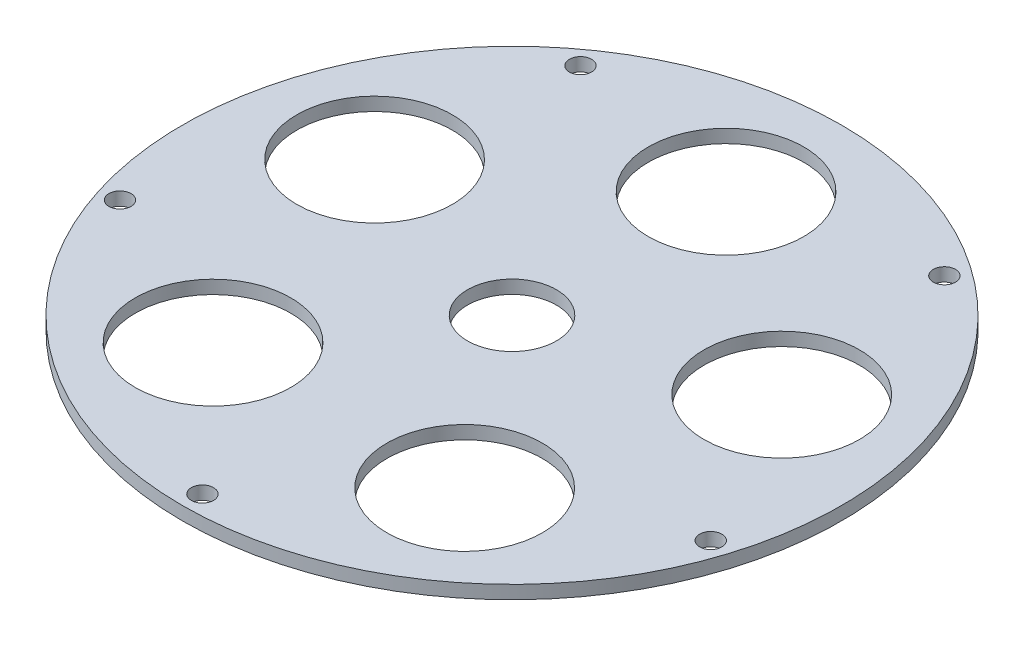
ISO-10303-21;
HEADER;
FILE_DESCRIPTION(('STEP AP214'),'2;1');
FILE_NAME('part.step','',(''),(''),'','','');
FILE_SCHEMA(('AUTOMOTIVE_DESIGN { 1 0 10303 214 1 1 1 1 }'));
ENDSEC;
DATA;
#1=APPLICATION_CONTEXT('core data for automotive mechanical design processes');
#2=APPLICATION_PROTOCOL_DEFINITION('international standard','automotive_design',2000,#1);
#3=PRODUCT_CONTEXT('',#1,'mechanical');
#4=PRODUCT('Part','Part','',(#3));
#5=PRODUCT_RELATED_PRODUCT_CATEGORY('part','',(#4));
#6=PRODUCT_DEFINITION_FORMATION('','',#4);
#7=PRODUCT_DEFINITION_CONTEXT('part definition',#1,'design');
#8=PRODUCT_DEFINITION('design','',#6,#7);
#9=PRODUCT_DEFINITION_SHAPE('','',#8);
#10=(LENGTH_UNIT() NAMED_UNIT(*) SI_UNIT(.MILLI.,.METRE.));
#11=(NAMED_UNIT(*) PLANE_ANGLE_UNIT() SI_UNIT($,.RADIAN.));
#12=(NAMED_UNIT(*) SI_UNIT($,.STERADIAN.) SOLID_ANGLE_UNIT());
#13=UNCERTAINTY_MEASURE_WITH_UNIT(LENGTH_MEASURE(1.E-05),#10,'distance_accuracy_value','');
#14=(GEOMETRIC_REPRESENTATION_CONTEXT(3) GLOBAL_UNCERTAINTY_ASSIGNED_CONTEXT((#13)) GLOBAL_UNIT_ASSIGNED_CONTEXT((#10,
#11,#12)) REPRESENTATION_CONTEXT('',''));
#15=CARTESIAN_POINT('',(0.,0.,0.));
#16=DIRECTION('',(0.,0.,1.));
#17=DIRECTION('',(1.,0.,0.));
#18=AXIS2_PLACEMENT_3D('',#15,#16,#17);
#19=CARTESIAN_POINT('',(0.,-3.,0.));
#20=DIRECTION('',(0.,1.,0.));
#21=DIRECTION('',(0.,0.,1.));
#22=AXIS2_PLACEMENT_3D('',#19,#20,#21);
#23=CYLINDRICAL_SURFACE('',#22,74.18267629);
#24=CARTESIAN_POINT('',(0.,-3.,0.));
#25=DIRECTION('',(0.,1.,0.));
#26=DIRECTION('',(0.,0.,1.));
#27=AXIS2_PLACEMENT_3D('',#24,#25,#26);
#28=CIRCLE('',#27,74.18267629);
#29=CARTESIAN_POINT('',(0.,-3.,74.18267629));
#30=VERTEX_POINT('',#29);
#31=EDGE_CURVE('E10',#30,#30,#28,.T.);
#32=ORIENTED_EDGE('',*,*,#31,.T.);
#33=EDGE_LOOP('',(#32));
#34=FACE_BOUND('',#33,.T.);
#35=CARTESIAN_POINT('',(0.,0.,0.));
#36=DIRECTION('',(0.,1.,0.));
#37=DIRECTION('',(0.,0.,1.));
#38=AXIS2_PLACEMENT_3D('',#35,#36,#37);
#39=CIRCLE('',#38,74.18267629);
#40=CARTESIAN_POINT('',(0.,0.,74.18267629));
#41=VERTEX_POINT('',#40);
#42=EDGE_CURVE('E34',#41,#41,#39,.T.);
#43=ORIENTED_EDGE('',*,*,#42,.F.);
#44=EDGE_LOOP('',(#43));
#45=FACE_BOUND('',#44,.T.);
#46=ADVANCED_FACE('F31',(#34,#45),#23,.T.);
#47=CARTESIAN_POINT('',(0.,-3.,0.));
#48=DIRECTION('',(0.,1.,0.));
#49=DIRECTION('',(0.,0.,1.));
#50=AXIS2_PLACEMENT_3D('',#47,#48,#49);
#51=PLANE('',#50);
#52=CARTESIAN_POINT('',(-66.6050331391941,-3.,21.6412871351681));
#53=DIRECTION('',(0.,1.,0.));
#54=DIRECTION('',(0.,0.,1.));
#55=AXIS2_PLACEMENT_3D('',#52,#53,#54);
#56=CIRCLE('',#55,2.50000000000001);
#57=CARTESIAN_POINT('',(-66.6050331391941,-3.,24.1412871351681));
#58=VERTEX_POINT('',#57);
#59=EDGE_CURVE('E68',#58,#58,#56,.T.);
#60=ORIENTED_EDGE('',*,*,#59,.T.);
#61=EDGE_LOOP('',(#60));
#62=FACE_BOUND('',#61,.T.);
#63=CARTESIAN_POINT('',(0.,-3.,69.68267629));
#64=DIRECTION('',(0.,1.,0.));
#65=DIRECTION('',(0.,0.,1.));
#66=AXIS2_PLACEMENT_3D('',#63,#64,#65);
#67=CIRCLE('',#66,2.5);
#68=CARTESIAN_POINT('',(0.,-3.,72.18267629));
#69=VERTEX_POINT('',#68);
#70=EDGE_CURVE('E81',#69,#69,#67,.T.);
#71=ORIENTED_EDGE('',*,*,#70,.T.);
#72=EDGE_LOOP('',(#71));
#73=FACE_BOUND('',#72,.T.);
#74=CARTESIAN_POINT('',(66.2721633584904,-3.,21.5331311871379));
#75=DIRECTION('',(0.,1.,0.));
#76=DIRECTION('',(0.,0.,1.));
#77=AXIS2_PLACEMENT_3D('',#74,#75,#76);
#78=CIRCLE('',#77,2.50000000000001);
#79=CARTESIAN_POINT('',(66.2721633584904,-3.,24.0331311871379));
#80=VERTEX_POINT('',#79);
#81=EDGE_CURVE('E84',#80,#80,#78,.T.);
#82=ORIENTED_EDGE('',*,*,#81,.T.);
#83=EDGE_LOOP('',(#82));
#84=FACE_BOUND('',#83,.T.);
#85=CARTESIAN_POINT('',(40.9584494635325,-3.,-56.3744693321382));
#86=DIRECTION('',(0.,1.,0.));
#87=DIRECTION('',(0.,0.,1.));
#88=AXIS2_PLACEMENT_3D('',#85,#86,#87);
#89=CIRCLE('',#88,2.5);
#90=CARTESIAN_POINT('',(40.9584494635325,-3.,-53.8744693321382));
#91=VERTEX_POINT('',#90);
#92=EDGE_CURVE('E87',#91,#91,#89,.T.);
#93=ORIENTED_EDGE('',*,*,#92,.T.);
#94=EDGE_LOOP('',(#93));
#95=FACE_BOUND('',#94,.T.);
#96=CARTESIAN_POINT('',(-40.9584494635321,-3.,-56.3744693321385));
#97=DIRECTION('',(0.,1.,0.));
#98=DIRECTION('',(0.,0.,1.));
#99=AXIS2_PLACEMENT_3D('',#96,#97,#98);
#100=CIRCLE('',#99,2.5);
#101=CARTESIAN_POINT('',(-40.9584494635321,-3.,-53.8744693321385));
#102=VERTEX_POINT('',#101);
#103=EDGE_CURVE('E90',#102,#102,#100,.T.);
#104=ORIENTED_EDGE('',*,*,#103,.T.);
#105=EDGE_LOOP('',(#104));
#106=FACE_BOUND('',#105,.T.);
#107=CARTESIAN_POINT('',(-45.8244482581448,-3.,-14.8892658080759));
#108=DIRECTION('',(0.,1.,0.));
#109=DIRECTION('',(0.,0.,1.));
#110=AXIS2_PLACEMENT_3D('',#107,#108,#109);
#111=CIRCLE('',#110,17.5);
#112=CARTESIAN_POINT('',(-45.8244482581448,-3.,2.61073419192412));
#113=VERTEX_POINT('',#112);
#114=EDGE_CURVE('E41',#113,#113,#111,.T.);
#115=ORIENTED_EDGE('',*,*,#114,.T.);
#116=EDGE_LOOP('',(#115));
#117=FACE_BOUND('',#116,.T.);
#118=CARTESIAN_POINT('',(28.3210665392446,-3.,38.9806039530766));
#119=DIRECTION('',(0.,1.,0.));
#120=DIRECTION('',(0.,0.,1.));
#121=AXIS2_PLACEMENT_3D('',#118,#119,#120);
#122=CIRCLE('',#121,17.5);
#123=CARTESIAN_POINT('',(28.3210665392446,-3.,56.4806039530766));
#124=VERTEX_POINT('',#123);
#125=EDGE_CURVE('E45',#124,#124,#122,.T.);
#126=ORIENTED_EDGE('',*,*,#125,.T.);
#127=EDGE_LOOP('',(#126));
#128=FACE_BOUND('',#127,.T.);
#129=CARTESIAN_POINT('',(45.8244482581444,-3.,-14.8892658080771));
#130=DIRECTION('',(0.,1.,0.));
#131=DIRECTION('',(0.,0.,1.));
#132=AXIS2_PLACEMENT_3D('',#129,#130,#131);
#133=CIRCLE('',#132,17.5);
#134=CARTESIAN_POINT('',(45.8244482581444,-3.,2.61073419192296));
#135=VERTEX_POINT('',#134);
#136=EDGE_CURVE('E48',#135,#135,#133,.T.);
#137=ORIENTED_EDGE('',*,*,#136,.T.);
#138=EDGE_LOOP('',(#137));
#139=FACE_BOUND('',#138,.T.);
#140=CARTESIAN_POINT('',(0.,-3.,-48.18267629));
#141=DIRECTION('',(0.,1.,0.));
#142=DIRECTION('',(0.,0.,1.));
#143=AXIS2_PLACEMENT_3D('',#140,#141,#142);
#144=CIRCLE('',#143,17.5);
#145=CARTESIAN_POINT('',(0.,-3.,-30.68267629));
#146=VERTEX_POINT('',#145);
#147=EDGE_CURVE('E51',#146,#146,#144,.T.);
#148=ORIENTED_EDGE('',*,*,#147,.T.);
#149=EDGE_LOOP('',(#148));
#150=FACE_BOUND('',#149,.T.);
#151=CARTESIAN_POINT('',(0.,-3.,0.));
#152=DIRECTION('',(0.,1.,0.));
#153=DIRECTION('',(0.,0.,1.));
#154=AXIS2_PLACEMENT_3D('',#151,#152,#153);
#155=CIRCLE('',#154,10.);
#156=CARTESIAN_POINT('',(0.,-3.,10.));
#157=VERTEX_POINT('',#156);
#158=EDGE_CURVE('E54',#157,#157,#155,.T.);
#159=ORIENTED_EDGE('',*,*,#158,.T.);
#160=EDGE_LOOP('',(#159));
#161=FACE_BOUND('',#160,.T.);
#162=CARTESIAN_POINT('',(-28.3210665392436,-3.,38.9806039530773));
#163=DIRECTION('',(0.,1.,0.));
#164=DIRECTION('',(0.,0.,1.));
#165=AXIS2_PLACEMENT_3D('',#162,#163,#164);
#166=CIRCLE('',#165,17.5);
#167=CARTESIAN_POINT('',(-28.3210665392436,-3.,56.4806039530773));
#168=VERTEX_POINT('',#167);
#169=EDGE_CURVE('E57',#168,#168,#166,.T.);
#170=ORIENTED_EDGE('',*,*,#169,.T.);
#171=EDGE_LOOP('',(#170));
#172=FACE_BOUND('',#171,.T.);
#173=ORIENTED_EDGE('',*,*,#31,.F.);
#174=EDGE_LOOP('',(#173));
#175=FACE_BOUND('',#174,.T.);
#176=ADVANCED_FACE('F116',(#62,#73,#84,#95,#106,#117,#128,#139,#150,#161,#172,#175),#51,.F.);
#177=CARTESIAN_POINT('',(0.,0.,0.));
#178=DIRECTION('',(0.,1.,0.));
#179=DIRECTION('',(0.,0.,1.));
#180=AXIS2_PLACEMENT_3D('',#177,#178,#179);
#181=PLANE('',#180);
#182=CARTESIAN_POINT('',(-66.6050331391941,0.,21.6412871351681));
#183=DIRECTION('',(0.,1.,0.));
#184=DIRECTION('',(0.,0.,1.));
#185=AXIS2_PLACEMENT_3D('',#182,#183,#184);
#186=CIRCLE('',#185,2.50000000000001);
#187=CARTESIAN_POINT('',(-66.6050331391941,0.,24.1412871351681));
#188=VERTEX_POINT('',#187);
#189=EDGE_CURVE('E93',#188,#188,#186,.T.);
#190=ORIENTED_EDGE('',*,*,#189,.F.);
#191=EDGE_LOOP('',(#190));
#192=FACE_BOUND('',#191,.T.);
#193=CARTESIAN_POINT('',(0.,0.,69.68267629));
#194=DIRECTION('',(0.,1.,0.));
#195=DIRECTION('',(0.,0.,1.));
#196=AXIS2_PLACEMENT_3D('',#193,#194,#195);
#197=CIRCLE('',#196,2.5);
#198=CARTESIAN_POINT('',(0.,0.,72.18267629));
#199=VERTEX_POINT('',#198);
#200=EDGE_CURVE('E103',#199,#199,#197,.T.);
#201=ORIENTED_EDGE('',*,*,#200,.F.);
#202=EDGE_LOOP('',(#201));
#203=FACE_BOUND('',#202,.T.);
#204=CARTESIAN_POINT('',(66.2721633584904,0.,21.5331311871379));
#205=DIRECTION('',(0.,1.,0.));
#206=DIRECTION('',(0.,0.,1.));
#207=AXIS2_PLACEMENT_3D('',#204,#205,#206);
#208=CIRCLE('',#207,2.50000000000001);
#209=CARTESIAN_POINT('',(66.2721633584904,0.,24.0331311871379));
#210=VERTEX_POINT('',#209);
#211=EDGE_CURVE('E100',#210,#210,#208,.T.);
#212=ORIENTED_EDGE('',*,*,#211,.F.);
#213=EDGE_LOOP('',(#212));
#214=FACE_BOUND('',#213,.T.);
#215=CARTESIAN_POINT('',(40.9584494635325,0.,-56.3744693321382));
#216=DIRECTION('',(0.,1.,0.));
#217=DIRECTION('',(0.,0.,1.));
#218=AXIS2_PLACEMENT_3D('',#215,#216,#217);
#219=CIRCLE('',#218,2.5);
#220=CARTESIAN_POINT('',(40.9584494635325,0.,-53.8744693321382));
#221=VERTEX_POINT('',#220);
#222=EDGE_CURVE('E97',#221,#221,#219,.T.);
#223=ORIENTED_EDGE('',*,*,#222,.F.);
#224=EDGE_LOOP('',(#223));
#225=FACE_BOUND('',#224,.T.);
#226=CARTESIAN_POINT('',(-40.9584494635321,0.,-56.3744693321385));
#227=DIRECTION('',(0.,1.,0.));
#228=DIRECTION('',(0.,0.,1.));
#229=AXIS2_PLACEMENT_3D('',#226,#227,#228);
#230=CIRCLE('',#229,2.5);
#231=CARTESIAN_POINT('',(-40.9584494635321,0.,-53.8744693321385));
#232=VERTEX_POINT('',#231);
#233=EDGE_CURVE('E94',#232,#232,#230,.T.);
#234=ORIENTED_EDGE('',*,*,#233,.F.);
#235=EDGE_LOOP('',(#234));
#236=FACE_BOUND('',#235,.T.);
#237=CARTESIAN_POINT('',(-45.8244482581448,0.,-14.8892658080759));
#238=DIRECTION('',(0.,1.,0.));
#239=DIRECTION('',(0.,0.,1.));
#240=AXIS2_PLACEMENT_3D('',#237,#238,#239);
#241=CIRCLE('',#240,17.5);
#242=CARTESIAN_POINT('',(-45.8244482581448,0.,2.61073419192412));
#243=VERTEX_POINT('',#242);
#244=EDGE_CURVE('E64',#243,#243,#241,.T.);
#245=ORIENTED_EDGE('',*,*,#244,.F.);
#246=EDGE_LOOP('',(#245));
#247=FACE_BOUND('',#246,.T.);
#248=CARTESIAN_POINT('',(28.3210665392446,0.,38.9806039530766));
#249=DIRECTION('',(0.,1.,0.));
#250=DIRECTION('',(0.,0.,1.));
#251=AXIS2_PLACEMENT_3D('',#248,#249,#250);
#252=CIRCLE('',#251,17.5);
#253=CARTESIAN_POINT('',(28.3210665392446,0.,56.4806039530766));
#254=VERTEX_POINT('',#253);
#255=EDGE_CURVE('E63',#254,#254,#252,.T.);
#256=ORIENTED_EDGE('',*,*,#255,.F.);
#257=EDGE_LOOP('',(#256));
#258=FACE_BOUND('',#257,.T.);
#259=CARTESIAN_POINT('',(45.8244482581444,0.,-14.8892658080771));
#260=DIRECTION('',(0.,1.,0.));
#261=DIRECTION('',(0.,0.,1.));
#262=AXIS2_PLACEMENT_3D('',#259,#260,#261);
#263=CIRCLE('',#262,17.5);
#264=CARTESIAN_POINT('',(45.8244482581444,0.,2.61073419192296));
#265=VERTEX_POINT('',#264);
#266=EDGE_CURVE('E69',#265,#265,#263,.T.);
#267=ORIENTED_EDGE('',*,*,#266,.F.);
#268=EDGE_LOOP('',(#267));
#269=FACE_BOUND('',#268,.T.);
#270=CARTESIAN_POINT('',(0.,0.,-48.18267629));
#271=DIRECTION('',(0.,1.,0.));
#272=DIRECTION('',(0.,0.,1.));
#273=AXIS2_PLACEMENT_3D('',#270,#271,#272);
#274=CIRCLE('',#273,17.5);
#275=CARTESIAN_POINT('',(0.,0.,-30.68267629));
#276=VERTEX_POINT('',#275);
#277=EDGE_CURVE('E72',#276,#276,#274,.T.);
#278=ORIENTED_EDGE('',*,*,#277,.F.);
#279=EDGE_LOOP('',(#278));
#280=FACE_BOUND('',#279,.T.);
#281=CARTESIAN_POINT('',(0.,0.,0.));
#282=DIRECTION('',(0.,1.,0.));
#283=DIRECTION('',(0.,0.,1.));
#284=AXIS2_PLACEMENT_3D('',#281,#282,#283);
#285=CIRCLE('',#284,10.);
#286=CARTESIAN_POINT('',(0.,0.,10.));
#287=VERTEX_POINT('',#286);
#288=EDGE_CURVE('E67',#287,#287,#285,.T.);
#289=ORIENTED_EDGE('',*,*,#288,.F.);
#290=EDGE_LOOP('',(#289));
#291=FACE_BOUND('',#290,.T.);
#292=CARTESIAN_POINT('',(-28.3210665392436,0.,38.9806039530773));
#293=DIRECTION('',(0.,1.,0.));
#294=DIRECTION('',(0.,0.,1.));
#295=AXIS2_PLACEMENT_3D('',#292,#293,#294);
#296=CIRCLE('',#295,17.5);
#297=CARTESIAN_POINT('',(-28.3210665392436,0.,56.4806039530773));
#298=VERTEX_POINT('',#297);
#299=EDGE_CURVE('E60',#298,#298,#296,.T.);
#300=ORIENTED_EDGE('',*,*,#299,.F.);
#301=EDGE_LOOP('',(#300));
#302=FACE_BOUND('',#301,.T.);
#303=ORIENTED_EDGE('',*,*,#42,.T.);
#304=EDGE_LOOP('',(#303));
#305=FACE_BOUND('',#304,.T.);
#306=ADVANCED_FACE('F112',(#192,#203,#214,#225,#236,#247,#258,#269,#280,#291,#302,#305),#181,.T.);
#307=CARTESIAN_POINT('',(-28.3210665392436,-4.,38.9806039530773));
#308=DIRECTION('',(0.,1.,0.));
#309=DIRECTION('',(0.,0.,1.));
#310=AXIS2_PLACEMENT_3D('',#307,#308,#309);
#311=CYLINDRICAL_SURFACE('',#310,17.5);
#312=ORIENTED_EDGE('',*,*,#299,.T.);
#313=EDGE_LOOP('',(#312));
#314=FACE_BOUND('',#313,.T.);
#315=ORIENTED_EDGE('',*,*,#169,.F.);
#316=EDGE_LOOP('',(#315));
#317=FACE_BOUND('',#316,.T.);
#318=ADVANCED_FACE('F115',(#314,#317),#311,.F.);
#319=CARTESIAN_POINT('',(0.,-4.,0.));
#320=DIRECTION('',(0.,1.,0.));
#321=DIRECTION('',(0.,0.,1.));
#322=AXIS2_PLACEMENT_3D('',#319,#320,#321);
#323=CYLINDRICAL_SURFACE('',#322,10.);
#324=ORIENTED_EDGE('',*,*,#288,.T.);
#325=EDGE_LOOP('',(#324));
#326=FACE_BOUND('',#325,.T.);
#327=ORIENTED_EDGE('',*,*,#158,.F.);
#328=EDGE_LOOP('',(#327));
#329=FACE_BOUND('',#328,.T.);
#330=ADVANCED_FACE('F151',(#326,#329),#323,.F.);
#331=CARTESIAN_POINT('',(0.,-4.,-48.18267629));
#332=DIRECTION('',(0.,1.,0.));
#333=DIRECTION('',(0.,0.,1.));
#334=AXIS2_PLACEMENT_3D('',#331,#332,#333);
#335=CYLINDRICAL_SURFACE('',#334,17.5);
#336=ORIENTED_EDGE('',*,*,#277,.T.);
#337=EDGE_LOOP('',(#336));
#338=FACE_BOUND('',#337,.T.);
#339=ORIENTED_EDGE('',*,*,#147,.F.);
#340=EDGE_LOOP('',(#339));
#341=FACE_BOUND('',#340,.T.);
#342=ADVANCED_FACE('F162',(#338,#341),#335,.F.);
#343=CARTESIAN_POINT('',(45.8244482581444,-4.,-14.8892658080771));
#344=DIRECTION('',(0.,1.,0.));
#345=DIRECTION('',(0.,0.,1.));
#346=AXIS2_PLACEMENT_3D('',#343,#344,#345);
#347=CYLINDRICAL_SURFACE('',#346,17.5);
#348=ORIENTED_EDGE('',*,*,#266,.T.);
#349=EDGE_LOOP('',(#348));
#350=FACE_BOUND('',#349,.T.);
#351=ORIENTED_EDGE('',*,*,#136,.F.);
#352=EDGE_LOOP('',(#351));
#353=FACE_BOUND('',#352,.T.);
#354=ADVANCED_FACE('F159',(#350,#353),#347,.F.);
#355=CARTESIAN_POINT('',(28.3210665392446,-4.,38.9806039530766));
#356=DIRECTION('',(0.,1.,0.));
#357=DIRECTION('',(0.,0.,1.));
#358=AXIS2_PLACEMENT_3D('',#355,#356,#357);
#359=CYLINDRICAL_SURFACE('',#358,17.5);
#360=ORIENTED_EDGE('',*,*,#255,.T.);
#361=EDGE_LOOP('',(#360));
#362=FACE_BOUND('',#361,.T.);
#363=ORIENTED_EDGE('',*,*,#125,.F.);
#364=EDGE_LOOP('',(#363));
#365=FACE_BOUND('',#364,.T.);
#366=ADVANCED_FACE('F157',(#362,#365),#359,.F.);
#367=CARTESIAN_POINT('',(-45.8244482581448,-4.,-14.8892658080759));
#368=DIRECTION('',(0.,1.,0.));
#369=DIRECTION('',(0.,0.,1.));
#370=AXIS2_PLACEMENT_3D('',#367,#368,#369);
#371=CYLINDRICAL_SURFACE('',#370,17.5);
#372=ORIENTED_EDGE('',*,*,#244,.T.);
#373=EDGE_LOOP('',(#372));
#374=FACE_BOUND('',#373,.T.);
#375=ORIENTED_EDGE('',*,*,#114,.F.);
#376=EDGE_LOOP('',(#375));
#377=FACE_BOUND('',#376,.T.);
#378=ADVANCED_FACE('F153',(#374,#377),#371,.F.);
#379=CARTESIAN_POINT('',(-40.9584494635321,-4.,-56.3744693321385));
#380=DIRECTION('',(0.,1.,0.));
#381=DIRECTION('',(0.,0.,1.));
#382=AXIS2_PLACEMENT_3D('',#379,#380,#381);
#383=CYLINDRICAL_SURFACE('',#382,2.5);
#384=ORIENTED_EDGE('',*,*,#233,.T.);
#385=EDGE_LOOP('',(#384));
#386=FACE_BOUND('',#385,.T.);
#387=ORIENTED_EDGE('',*,*,#103,.F.);
#388=EDGE_LOOP('',(#387));
#389=FACE_BOUND('',#388,.T.);
#390=ADVANCED_FACE('F156',(#386,#389),#383,.F.);
#391=CARTESIAN_POINT('',(40.9584494635325,-4.,-56.3744693321382));
#392=DIRECTION('',(0.,1.,0.));
#393=DIRECTION('',(0.,0.,1.));
#394=AXIS2_PLACEMENT_3D('',#391,#392,#393);
#395=CYLINDRICAL_SURFACE('',#394,2.5);
#396=ORIENTED_EDGE('',*,*,#222,.T.);
#397=EDGE_LOOP('',(#396));
#398=FACE_BOUND('',#397,.T.);
#399=ORIENTED_EDGE('',*,*,#92,.F.);
#400=EDGE_LOOP('',(#399));
#401=FACE_BOUND('',#400,.T.);
#402=ADVANCED_FACE('F175',(#398,#401),#395,.F.);
#403=CARTESIAN_POINT('',(66.2721633584904,-4.,21.5331311871379));
#404=DIRECTION('',(0.,1.,0.));
#405=DIRECTION('',(0.,0.,1.));
#406=AXIS2_PLACEMENT_3D('',#403,#404,#405);
#407=CYLINDRICAL_SURFACE('',#406,2.50000000000001);
#408=ORIENTED_EDGE('',*,*,#211,.T.);
#409=EDGE_LOOP('',(#408));
#410=FACE_BOUND('',#409,.T.);
#411=ORIENTED_EDGE('',*,*,#81,.F.);
#412=EDGE_LOOP('',(#411));
#413=FACE_BOUND('',#412,.T.);
#414=ADVANCED_FACE('F179',(#410,#413),#407,.F.);
#415=CARTESIAN_POINT('',(0.,-4.,69.68267629));
#416=DIRECTION('',(0.,1.,0.));
#417=DIRECTION('',(0.,0.,1.));
#418=AXIS2_PLACEMENT_3D('',#415,#416,#417);
#419=CYLINDRICAL_SURFACE('',#418,2.5);
#420=ORIENTED_EDGE('',*,*,#200,.T.);
#421=EDGE_LOOP('',(#420));
#422=FACE_BOUND('',#421,.T.);
#423=ORIENTED_EDGE('',*,*,#70,.F.);
#424=EDGE_LOOP('',(#423));
#425=FACE_BOUND('',#424,.T.);
#426=ADVANCED_FACE('F183',(#422,#425),#419,.F.);
#427=CARTESIAN_POINT('',(-66.6050331391941,-4.,21.6412871351681));
#428=DIRECTION('',(0.,1.,0.));
#429=DIRECTION('',(0.,0.,1.));
#430=AXIS2_PLACEMENT_3D('',#427,#428,#429);
#431=CYLINDRICAL_SURFACE('',#430,2.50000000000001);
#432=ORIENTED_EDGE('',*,*,#189,.T.);
#433=EDGE_LOOP('',(#432));
#434=FACE_BOUND('',#433,.T.);
#435=ORIENTED_EDGE('',*,*,#59,.F.);
#436=EDGE_LOOP('',(#435));
#437=FACE_BOUND('',#436,.T.);
#438=ADVANCED_FACE('F109',(#434,#437),#431,.F.);
#439=CLOSED_SHELL('',(#46,#176,#306,#318,#330,#342,#354,#366,#378,#390,#402,#414,#426,#438));
#440=MANIFOLD_SOLID_BREP('B2',#439);
#441=ADVANCED_BREP_SHAPE_REPRESENTATION('',(#18,#440),#14);
#442=SHAPE_DEFINITION_REPRESENTATION(#9,#441);
ENDSEC;
END-ISO-10303-21;
